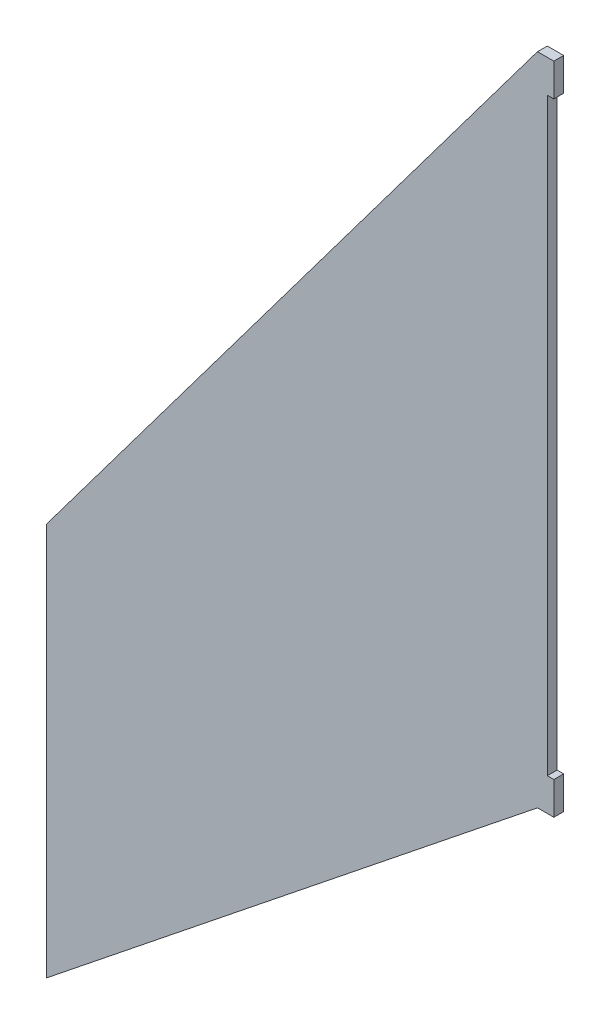
ISO-10303-21;
HEADER;
FILE_DESCRIPTION(('STEP AP214'),'2;1');
FILE_NAME('part.step','',(''),(''),'','','');
FILE_SCHEMA(('AUTOMOTIVE_DESIGN { 1 0 10303 214 1 1 1 1 }'));
ENDSEC;
DATA;
#1=APPLICATION_CONTEXT('core data for automotive mechanical design processes');
#2=APPLICATION_PROTOCOL_DEFINITION('international standard','automotive_design',2000,#1);
#3=PRODUCT_CONTEXT('',#1,'mechanical');
#4=PRODUCT('Part','Part','',(#3));
#5=PRODUCT_RELATED_PRODUCT_CATEGORY('part','',(#4));
#6=PRODUCT_DEFINITION_FORMATION('','',#4);
#7=PRODUCT_DEFINITION_CONTEXT('part definition',#1,'design');
#8=PRODUCT_DEFINITION('design','',#6,#7);
#9=PRODUCT_DEFINITION_SHAPE('','',#8);
#10=(LENGTH_UNIT() NAMED_UNIT(*) SI_UNIT(.MILLI.,.METRE.));
#11=(NAMED_UNIT(*) PLANE_ANGLE_UNIT() SI_UNIT($,.RADIAN.));
#12=(NAMED_UNIT(*) SI_UNIT($,.STERADIAN.) SOLID_ANGLE_UNIT());
#13=UNCERTAINTY_MEASURE_WITH_UNIT(LENGTH_MEASURE(1.E-05),#10,'distance_accuracy_value','');
#14=(GEOMETRIC_REPRESENTATION_CONTEXT(3) GLOBAL_UNCERTAINTY_ASSIGNED_CONTEXT((#13)) GLOBAL_UNIT_ASSIGNED_CONTEXT((#10,
#11,#12)) REPRESENTATION_CONTEXT('',''));
#15=CARTESIAN_POINT('',(0.,0.,0.));
#16=DIRECTION('',(0.,0.,1.));
#17=DIRECTION('',(1.,0.,0.));
#18=AXIS2_PLACEMENT_3D('',#15,#16,#17);
#19=CARTESIAN_POINT('',(0.,0.,3.));
#20=DIRECTION('',(-1.,0.,0.));
#21=DIRECTION('',(0.,-1.,0.));
#22=AXIS2_PLACEMENT_3D('',#19,#20,#21);
#23=PLANE('',#22);
#24=DIRECTION('',(0.,1.,0.));
#25=VECTOR('',#24,1.);
#26=CARTESIAN_POINT('',(0.,0.,0.));
#27=LINE('',#26,#25);
#28=CARTESIAN_POINT('',(0.,-10.,0.));
#29=VERTEX_POINT('',#28);
#30=CARTESIAN_POINT('',(0.,0.,0.));
#31=VERTEX_POINT('',#30);
#32=EDGE_CURVE('E141',#29,#31,#27,.T.);
#33=ORIENTED_EDGE('',*,*,#32,.T.);
#34=DIRECTION('',(0.,0.,-1.));
#35=VECTOR('',#34,1.);
#36=CARTESIAN_POINT('',(0.,0.,3.));
#37=LINE('',#36,#35);
#38=CARTESIAN_POINT('',(0.,0.,3.));
#39=VERTEX_POINT('',#38);
#40=EDGE_CURVE('E11',#39,#31,#37,.T.);
#41=ORIENTED_EDGE('',*,*,#40,.F.);
#42=DIRECTION('',(0.,1.,0.));
#43=VECTOR('',#42,1.);
#44=CARTESIAN_POINT('',(0.,0.,3.));
#45=LINE('',#44,#43);
#46=CARTESIAN_POINT('',(0.,-10.,3.));
#47=VERTEX_POINT('',#46);
#48=EDGE_CURVE('E159',#47,#39,#45,.T.);
#49=ORIENTED_EDGE('',*,*,#48,.F.);
#50=DIRECTION('',(0.,0.,-1.));
#51=VECTOR('',#50,1.);
#52=CARTESIAN_POINT('',(0.,-10.,3.));
#53=LINE('',#52,#51);
#54=EDGE_CURVE('E137',#47,#29,#53,.T.);
#55=ORIENTED_EDGE('',*,*,#54,.T.);
#56=EDGE_LOOP('',(#33,#41,#49,#55));
#57=FACE_BOUND('',#56,.T.);
#58=ADVANCED_FACE('F33',(#57),#23,.F.);
#59=CARTESIAN_POINT('',(0.,0.,3.));
#60=DIRECTION('',(0.,-1.,0.));
#61=DIRECTION('',(1.,0.,0.));
#62=AXIS2_PLACEMENT_3D('',#59,#60,#61);
#63=PLANE('',#62);
#64=DIRECTION('',(-1.,0.,0.));
#65=VECTOR('',#64,1.);
#66=CARTESIAN_POINT('',(0.,0.,0.));
#67=LINE('',#66,#65);
#68=CARTESIAN_POINT('',(-5.,0.,0.));
#69=VERTEX_POINT('',#68);
#70=EDGE_CURVE('E144',#31,#69,#67,.T.);
#71=ORIENTED_EDGE('',*,*,#70,.T.);
#72=DIRECTION('',(0.,0.,-1.));
#73=VECTOR('',#72,1.);
#74=CARTESIAN_POINT('',(-5.,0.,3.));
#75=LINE('',#74,#73);
#76=CARTESIAN_POINT('',(-5.,0.,3.));
#77=VERTEX_POINT('',#76);
#78=EDGE_CURVE('E41',#77,#69,#75,.T.);
#79=ORIENTED_EDGE('',*,*,#78,.F.);
#80=DIRECTION('',(-1.,0.,0.));
#81=VECTOR('',#80,1.);
#82=CARTESIAN_POINT('',(0.,0.,3.));
#83=LINE('',#82,#81);
#84=EDGE_CURVE('E98',#39,#77,#83,.T.);
#85=ORIENTED_EDGE('',*,*,#84,.F.);
#86=ORIENTED_EDGE('',*,*,#40,.T.);
#87=EDGE_LOOP('',(#71,#79,#85,#86));
#88=FACE_BOUND('',#87,.T.);
#89=ADVANCED_FACE('F208',(#88),#63,.F.);
#90=CARTESIAN_POINT('',(-5.,0.,3.));
#91=DIRECTION('',(0.8,-0.6,0.));
#92=DIRECTION('',(0.6,0.8,0.));
#93=AXIS2_PLACEMENT_3D('',#90,#91,#92);
#94=PLANE('',#93);
#95=DIRECTION('',(-0.6,-0.8,0.));
#96=VECTOR('',#95,1.);
#97=CARTESIAN_POINT('',(-5.,0.,0.));
#98=LINE('',#97,#96);
#99=CARTESIAN_POINT('',(-155.,-200.,0.));
#100=VERTEX_POINT('',#99);
#101=EDGE_CURVE('E146',#69,#100,#98,.T.);
#102=ORIENTED_EDGE('',*,*,#101,.T.);
#103=DIRECTION('',(0.,0.,-1.));
#104=VECTOR('',#103,1.);
#105=CARTESIAN_POINT('',(-155.,-200.,3.));
#106=LINE('',#105,#104);
#107=CARTESIAN_POINT('',(-155.,-200.,3.));
#108=VERTEX_POINT('',#107);
#109=EDGE_CURVE('E172',#108,#100,#106,.T.);
#110=ORIENTED_EDGE('',*,*,#109,.F.);
#111=DIRECTION('',(-0.6,-0.8,0.));
#112=VECTOR('',#111,1.);
#113=CARTESIAN_POINT('',(-5.,0.,3.));
#114=LINE('',#113,#112);
#115=EDGE_CURVE('E180',#77,#108,#114,.T.);
#116=ORIENTED_EDGE('',*,*,#115,.F.);
#117=ORIENTED_EDGE('',*,*,#78,.T.);
#118=EDGE_LOOP('',(#102,#110,#116,#117));
#119=FACE_BOUND('',#118,.T.);
#120=ADVANCED_FACE('F178',(#119),#94,.F.);
#121=CARTESIAN_POINT('',(-155.,-200.,3.));
#122=DIRECTION('',(1.,0.,0.));
#123=DIRECTION('',(0.,1.,0.));
#124=AXIS2_PLACEMENT_3D('',#121,#122,#123);
#125=PLANE('',#124);
#126=DIRECTION('',(0.,-1.,0.));
#127=VECTOR('',#126,1.);
#128=CARTESIAN_POINT('',(-155.,-200.,0.));
#129=LINE('',#128,#127);
#130=CARTESIAN_POINT('',(-155.,-320.,0.));
#131=VERTEX_POINT('',#130);
#132=EDGE_CURVE('E148',#100,#131,#129,.T.);
#133=ORIENTED_EDGE('',*,*,#132,.T.);
#134=DIRECTION('',(0.,0.,-1.));
#135=VECTOR('',#134,1.);
#136=CARTESIAN_POINT('',(-155.,-320.,3.));
#137=LINE('',#136,#135);
#138=CARTESIAN_POINT('',(-155.,-320.,3.));
#139=VERTEX_POINT('',#138);
#140=EDGE_CURVE('E169',#139,#131,#137,.T.);
#141=ORIENTED_EDGE('',*,*,#140,.F.);
#142=DIRECTION('',(0.,-1.,0.));
#143=VECTOR('',#142,1.);
#144=CARTESIAN_POINT('',(-155.,-200.,3.));
#145=LINE('',#144,#143);
#146=EDGE_CURVE('E198',#108,#139,#145,.T.);
#147=ORIENTED_EDGE('',*,*,#146,.F.);
#148=ORIENTED_EDGE('',*,*,#109,.T.);
#149=EDGE_LOOP('',(#133,#141,#147,#148));
#150=FACE_BOUND('',#149,.T.);
#151=ADVANCED_FACE('F189',(#150),#125,.F.);
#152=CARTESIAN_POINT('',(-155.,-320.,3.));
#153=DIRECTION('',(-0.624695047554425,0.78086880944303,0.));
#154=DIRECTION('',(-0.78086880944303,-0.624695047554425,0.));
#155=AXIS2_PLACEMENT_3D('',#152,#153,#154);
#156=PLANE('',#155);
#157=DIRECTION('',(0.78086880944303,0.624695047554425,0.));
#158=VECTOR('',#157,1.);
#159=CARTESIAN_POINT('',(-155.,-320.,0.));
#160=LINE('',#159,#158);
#161=CARTESIAN_POINT('',(-4.99999999999998,-200.,0.));
#162=VERTEX_POINT('',#161);
#163=EDGE_CURVE('E150',#131,#162,#160,.T.);
#164=ORIENTED_EDGE('',*,*,#163,.T.);
#165=DIRECTION('',(0.,0.,-1.));
#166=VECTOR('',#165,1.);
#167=CARTESIAN_POINT('',(-4.99999999999998,-200.,3.));
#168=LINE('',#167,#166);
#169=CARTESIAN_POINT('',(-4.99999999999998,-200.,3.));
#170=VERTEX_POINT('',#169);
#171=EDGE_CURVE('E166',#170,#162,#168,.T.);
#172=ORIENTED_EDGE('',*,*,#171,.F.);
#173=DIRECTION('',(0.78086880944303,0.624695047554425,0.));
#174=VECTOR('',#173,1.);
#175=CARTESIAN_POINT('',(-155.,-320.,3.));
#176=LINE('',#175,#174);
#177=EDGE_CURVE('E195',#139,#170,#176,.T.);
#178=ORIENTED_EDGE('',*,*,#177,.F.);
#179=ORIENTED_EDGE('',*,*,#140,.T.);
#180=EDGE_LOOP('',(#164,#172,#178,#179));
#181=FACE_BOUND('',#180,.T.);
#182=ADVANCED_FACE('F193',(#181),#156,.F.);
#183=CARTESIAN_POINT('',(-4.99999999999998,-200.,3.));
#184=DIRECTION('',(0.,1.,0.));
#185=DIRECTION('',(-1.,0.,0.));
#186=AXIS2_PLACEMENT_3D('',#183,#184,#185);
#187=PLANE('',#186);
#188=DIRECTION('',(1.,0.,0.));
#189=VECTOR('',#188,1.);
#190=CARTESIAN_POINT('',(-4.99999999999998,-200.,0.));
#191=LINE('',#190,#189);
#192=CARTESIAN_POINT('',(0.,-200.,0.));
#193=VERTEX_POINT('',#192);
#194=EDGE_CURVE('E152',#162,#193,#191,.T.);
#195=ORIENTED_EDGE('',*,*,#194,.T.);
#196=DIRECTION('',(0.,0.,-1.));
#197=VECTOR('',#196,1.);
#198=CARTESIAN_POINT('',(0.,-200.,3.));
#199=LINE('',#198,#197);
#200=CARTESIAN_POINT('',(0.,-200.,3.));
#201=VERTEX_POINT('',#200);
#202=EDGE_CURVE('E163',#201,#193,#199,.T.);
#203=ORIENTED_EDGE('',*,*,#202,.F.);
#204=DIRECTION('',(1.,0.,0.));
#205=VECTOR('',#204,1.);
#206=CARTESIAN_POINT('',(-4.99999999999998,-200.,3.));
#207=LINE('',#206,#205);
#208=EDGE_CURVE('E197',#170,#201,#207,.T.);
#209=ORIENTED_EDGE('',*,*,#208,.F.);
#210=ORIENTED_EDGE('',*,*,#171,.T.);
#211=EDGE_LOOP('',(#195,#203,#209,#210));
#212=FACE_BOUND('',#211,.T.);
#213=ADVANCED_FACE('F220',(#212),#187,.F.);
#214=CARTESIAN_POINT('',(0.,-200.,3.));
#215=DIRECTION('',(-1.,0.,0.));
#216=DIRECTION('',(0.,0.,1.));
#217=AXIS2_PLACEMENT_3D('',#214,#215,#216);
#218=PLANE('',#217);
#219=DIRECTION('',(0.,1.,0.));
#220=VECTOR('',#219,1.);
#221=CARTESIAN_POINT('',(0.,-200.,0.));
#222=LINE('',#221,#220);
#223=CARTESIAN_POINT('',(0.,-190.,0.));
#224=VERTEX_POINT('',#223);
#225=EDGE_CURVE('E154',#193,#224,#222,.T.);
#226=ORIENTED_EDGE('',*,*,#225,.T.);
#227=DIRECTION('',(0.,0.,-1.));
#228=VECTOR('',#227,1.);
#229=CARTESIAN_POINT('',(0.,-190.,3.));
#230=LINE('',#229,#228);
#231=CARTESIAN_POINT('',(0.,-190.,3.));
#232=VERTEX_POINT('',#231);
#233=EDGE_CURVE('E132',#232,#224,#230,.T.);
#234=ORIENTED_EDGE('',*,*,#233,.F.);
#235=DIRECTION('',(0.,1.,0.));
#236=VECTOR('',#235,1.);
#237=CARTESIAN_POINT('',(0.,-200.,3.));
#238=LINE('',#237,#236);
#239=EDGE_CURVE('E123',#201,#232,#238,.T.);
#240=ORIENTED_EDGE('',*,*,#239,.F.);
#241=ORIENTED_EDGE('',*,*,#202,.T.);
#242=EDGE_LOOP('',(#226,#234,#240,#241));
#243=FACE_BOUND('',#242,.T.);
#244=ADVANCED_FACE('F223',(#243),#218,.F.);
#245=CARTESIAN_POINT('',(0.,-190.,3.));
#246=DIRECTION('',(0.,-1.,0.));
#247=DIRECTION('',(1.,0.,0.));
#248=AXIS2_PLACEMENT_3D('',#245,#246,#247);
#249=PLANE('',#248);
#250=DIRECTION('',(-1.,0.,0.));
#251=VECTOR('',#250,1.);
#252=CARTESIAN_POINT('',(0.,-190.,0.));
#253=LINE('',#252,#251);
#254=CARTESIAN_POINT('',(-1.99999999999997,-190.,0.));
#255=VERTEX_POINT('',#254);
#256=EDGE_CURVE('E131',#224,#255,#253,.T.);
#257=ORIENTED_EDGE('',*,*,#256,.T.);
#258=DIRECTION('',(0.,0.,-1.));
#259=VECTOR('',#258,1.);
#260=CARTESIAN_POINT('',(-1.99999999999997,-190.,3.));
#261=LINE('',#260,#259);
#262=CARTESIAN_POINT('',(-1.99999999999997,-190.,3.));
#263=VERTEX_POINT('',#262);
#264=EDGE_CURVE('E128',#263,#255,#261,.T.);
#265=ORIENTED_EDGE('',*,*,#264,.F.);
#266=DIRECTION('',(-1.,0.,0.));
#267=VECTOR('',#266,1.);
#268=CARTESIAN_POINT('',(0.,-190.,3.));
#269=LINE('',#268,#267);
#270=EDGE_CURVE('E117',#232,#263,#269,.T.);
#271=ORIENTED_EDGE('',*,*,#270,.F.);
#272=ORIENTED_EDGE('',*,*,#233,.T.);
#273=EDGE_LOOP('',(#257,#265,#271,#272));
#274=FACE_BOUND('',#273,.T.);
#275=ADVANCED_FACE('F129',(#274),#249,.F.);
#276=CARTESIAN_POINT('',(-2.,-10.,3.));
#277=DIRECTION('',(-1.,0.,0.));
#278=DIRECTION('',(0.,-1.,0.));
#279=AXIS2_PLACEMENT_3D('',#276,#277,#278);
#280=PLANE('',#279);
#281=DIRECTION('',(0.,1.,0.));
#282=VECTOR('',#281,1.);
#283=CARTESIAN_POINT('',(-2.,-10.,0.));
#284=LINE('',#283,#282);
#285=CARTESIAN_POINT('',(-2.,-10.,0.));
#286=VERTEX_POINT('',#285);
#287=EDGE_CURVE('E84',#255,#286,#284,.T.);
#288=ORIENTED_EDGE('',*,*,#287,.T.);
#289=DIRECTION('',(0.,0.,-1.));
#290=VECTOR('',#289,1.);
#291=CARTESIAN_POINT('',(-2.,-10.,3.));
#292=LINE('',#291,#290);
#293=CARTESIAN_POINT('',(-2.,-10.,3.));
#294=VERTEX_POINT('',#293);
#295=EDGE_CURVE('E133',#294,#286,#292,.T.);
#296=ORIENTED_EDGE('',*,*,#295,.F.);
#297=DIRECTION('',(0.,1.,0.));
#298=VECTOR('',#297,1.);
#299=CARTESIAN_POINT('',(-2.,-10.,3.));
#300=LINE('',#299,#298);
#301=EDGE_CURVE('E121',#263,#294,#300,.T.);
#302=ORIENTED_EDGE('',*,*,#301,.F.);
#303=ORIENTED_EDGE('',*,*,#264,.T.);
#304=EDGE_LOOP('',(#288,#296,#302,#303));
#305=FACE_BOUND('',#304,.T.);
#306=ADVANCED_FACE('F135',(#305),#280,.F.);
#307=CARTESIAN_POINT('',(0.,-10.,3.));
#308=DIRECTION('',(0.,1.,0.));
#309=DIRECTION('',(0.,0.,1.));
#310=AXIS2_PLACEMENT_3D('',#307,#308,#309);
#311=PLANE('',#310);
#312=DIRECTION('',(1.,0.,0.));
#313=VECTOR('',#312,1.);
#314=CARTESIAN_POINT('',(0.,-10.,0.));
#315=LINE('',#314,#313);
#316=EDGE_CURVE('E90',#286,#29,#315,.T.);
#317=ORIENTED_EDGE('',*,*,#316,.T.);
#318=ORIENTED_EDGE('',*,*,#54,.F.);
#319=DIRECTION('',(1.,0.,0.));
#320=VECTOR('',#319,1.);
#321=CARTESIAN_POINT('',(0.,-10.,3.));
#322=LINE('',#321,#320);
#323=EDGE_CURVE('E49',#294,#47,#322,.T.);
#324=ORIENTED_EDGE('',*,*,#323,.F.);
#325=ORIENTED_EDGE('',*,*,#295,.T.);
#326=EDGE_LOOP('',(#317,#318,#324,#325));
#327=FACE_BOUND('',#326,.T.);
#328=ADVANCED_FACE('F232',(#327),#311,.F.);
#329=CARTESIAN_POINT('',(0.,0.,3.));
#330=DIRECTION('',(0.,0.,-1.));
#331=DIRECTION('',(-1.,0.,0.));
#332=AXIS2_PLACEMENT_3D('',#329,#330,#331);
#333=PLANE('',#332);
#334=ORIENTED_EDGE('',*,*,#48,.T.);
#335=ORIENTED_EDGE('',*,*,#84,.T.);
#336=ORIENTED_EDGE('',*,*,#115,.T.);
#337=ORIENTED_EDGE('',*,*,#146,.T.);
#338=ORIENTED_EDGE('',*,*,#177,.T.);
#339=ORIENTED_EDGE('',*,*,#208,.T.);
#340=ORIENTED_EDGE('',*,*,#239,.T.);
#341=ORIENTED_EDGE('',*,*,#270,.T.);
#342=ORIENTED_EDGE('',*,*,#301,.T.);
#343=ORIENTED_EDGE('',*,*,#323,.T.);
#344=EDGE_LOOP('',(#334,#335,#336,#337,#338,#339,#340,#341,#342,#343));
#345=FACE_BOUND('',#344,.T.);
#346=ADVANCED_FACE('F119',(#345),#333,.F.);
#347=CARTESIAN_POINT('',(0.,0.,0.));
#348=DIRECTION('',(0.,0.,-1.));
#349=DIRECTION('',(-1.,0.,0.));
#350=AXIS2_PLACEMENT_3D('',#347,#348,#349);
#351=PLANE('',#350);
#352=ORIENTED_EDGE('',*,*,#32,.F.);
#353=ORIENTED_EDGE('',*,*,#316,.F.);
#354=ORIENTED_EDGE('',*,*,#287,.F.);
#355=ORIENTED_EDGE('',*,*,#256,.F.);
#356=ORIENTED_EDGE('',*,*,#225,.F.);
#357=ORIENTED_EDGE('',*,*,#194,.F.);
#358=ORIENTED_EDGE('',*,*,#163,.F.);
#359=ORIENTED_EDGE('',*,*,#132,.F.);
#360=ORIENTED_EDGE('',*,*,#101,.F.);
#361=ORIENTED_EDGE('',*,*,#70,.F.);
#362=EDGE_LOOP('',(#352,#353,#354,#355,#356,#357,#358,#359,#360,#361));
#363=FACE_BOUND('',#362,.T.);
#364=ADVANCED_FACE('F184',(#363),#351,.T.);
#365=CLOSED_SHELL('',(#58,#89,#120,#151,#182,#213,#244,#275,#306,#328,#346,#364));
#366=MANIFOLD_SOLID_BREP('B2',#365);
#367=ADVANCED_BREP_SHAPE_REPRESENTATION('',(#18,#366),#14);
#368=SHAPE_DEFINITION_REPRESENTATION(#9,#367);
ENDSEC;
END-ISO-10303-21;
